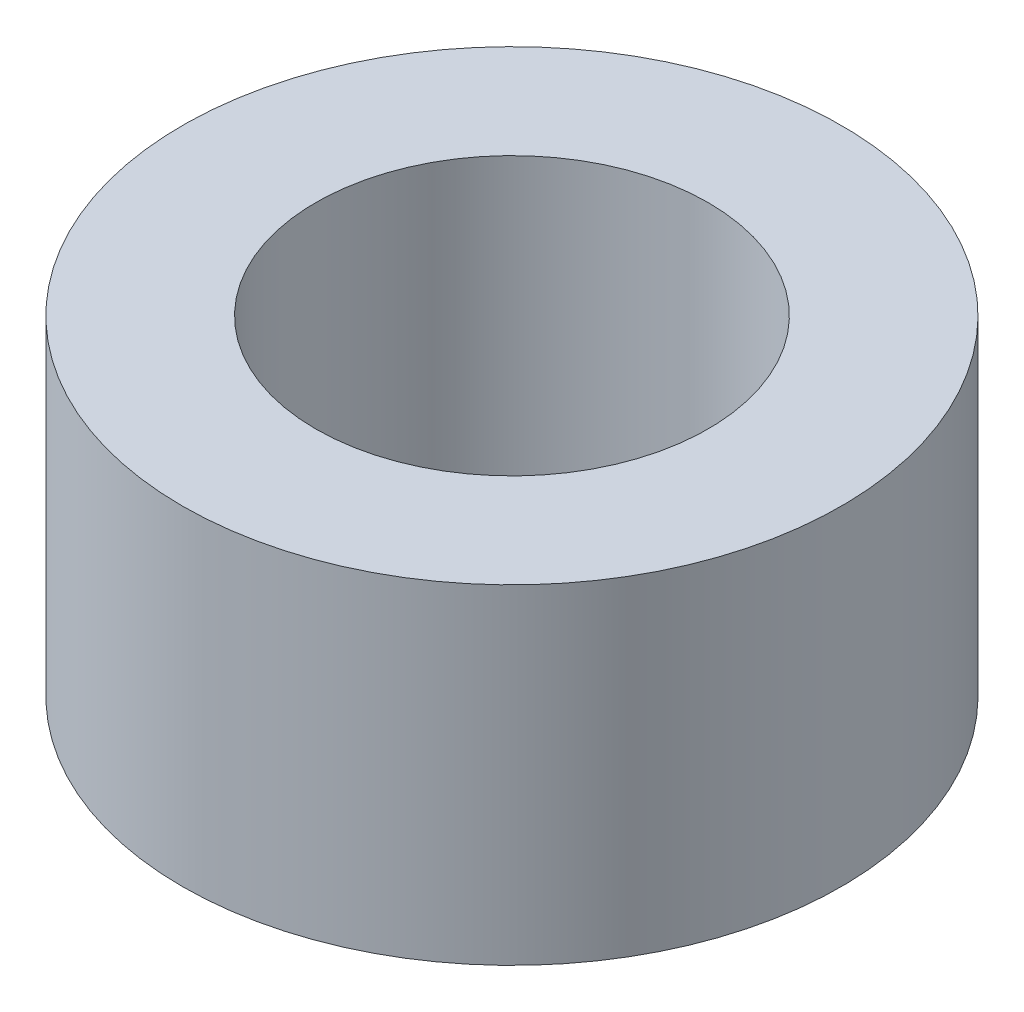
ISO-10303-21;
HEADER;
FILE_DESCRIPTION(('STEP AP214'),'2;1');
FILE_NAME('part.step','',(''),(''),'','','');
FILE_SCHEMA(('AUTOMOTIVE_DESIGN { 1 0 10303 214 1 1 1 1 }'));
ENDSEC;
DATA;
#1=APPLICATION_CONTEXT('core data for automotive mechanical design processes');
#2=APPLICATION_PROTOCOL_DEFINITION('international standard','automotive_design',2000,#1);
#3=PRODUCT_CONTEXT('',#1,'mechanical');
#4=PRODUCT('Part','Part','',(#3));
#5=PRODUCT_RELATED_PRODUCT_CATEGORY('part','',(#4));
#6=PRODUCT_DEFINITION_FORMATION('','',#4);
#7=PRODUCT_DEFINITION_CONTEXT('part definition',#1,'design');
#8=PRODUCT_DEFINITION('design','',#6,#7);
#9=PRODUCT_DEFINITION_SHAPE('','',#8);
#10=(LENGTH_UNIT() NAMED_UNIT(*) SI_UNIT(.MILLI.,.METRE.));
#11=(NAMED_UNIT(*) PLANE_ANGLE_UNIT() SI_UNIT($,.RADIAN.));
#12=(NAMED_UNIT(*) SI_UNIT($,.STERADIAN.) SOLID_ANGLE_UNIT());
#13=UNCERTAINTY_MEASURE_WITH_UNIT(LENGTH_MEASURE(1.E-05),#10,'distance_accuracy_value','');
#14=(GEOMETRIC_REPRESENTATION_CONTEXT(3) GLOBAL_UNCERTAINTY_ASSIGNED_CONTEXT((#13)) GLOBAL_UNIT_ASSIGNED_CONTEXT((#10,
#11,#12)) REPRESENTATION_CONTEXT('',''));
#15=CARTESIAN_POINT('',(0.,0.,0.));
#16=DIRECTION('',(0.,0.,1.));
#17=DIRECTION('',(1.,0.,0.));
#18=AXIS2_PLACEMENT_3D('',#15,#16,#17);
#19=CARTESIAN_POINT('',(0.,21.,0.));
#20=DIRECTION('',(0.,1.,0.));
#21=DIRECTION('',(0.,0.,1.));
#22=AXIS2_PLACEMENT_3D('',#19,#20,#21);
#23=PLANE('',#22);
#24=CARTESIAN_POINT('',(0.,21.,0.));
#25=DIRECTION('',(0.,1.,0.));
#26=DIRECTION('',(0.,0.,1.));
#27=AXIS2_PLACEMENT_3D('',#24,#25,#26);
#28=CIRCLE('',#27,21.);
#29=CARTESIAN_POINT('',(0.,21.,21.));
#30=VERTEX_POINT('',#29);
#31=EDGE_CURVE('E10',#30,#30,#28,.T.);
#32=ORIENTED_EDGE('',*,*,#31,.T.);
#33=EDGE_LOOP('',(#32));
#34=FACE_BOUND('',#33,.T.);
#35=CARTESIAN_POINT('',(0.,21.,0.));
#36=DIRECTION('',(0.,1.,0.));
#37=DIRECTION('',(0.,0.,1.));
#38=AXIS2_PLACEMENT_3D('',#35,#36,#37);
#39=CIRCLE('',#38,12.5);
#40=CARTESIAN_POINT('',(0.,21.,12.5));
#41=VERTEX_POINT('',#40);
#42=EDGE_CURVE('E43',#41,#41,#39,.T.);
#43=ORIENTED_EDGE('',*,*,#42,.F.);
#44=EDGE_LOOP('',(#43));
#45=FACE_BOUND('',#44,.T.);
#46=ADVANCED_FACE('F32',(#34,#45),#23,.T.);
#47=CARTESIAN_POINT('',(0.,0.,0.));
#48=DIRECTION('',(0.,1.,0.));
#49=DIRECTION('',(0.,0.,1.));
#50=AXIS2_PLACEMENT_3D('',#47,#48,#49);
#51=PLANE('',#50);
#52=CARTESIAN_POINT('',(0.,0.,0.));
#53=DIRECTION('',(0.,1.,0.));
#54=DIRECTION('',(0.,0.,1.));
#55=AXIS2_PLACEMENT_3D('',#52,#53,#54);
#56=CIRCLE('',#55,21.);
#57=CARTESIAN_POINT('',(0.,0.,21.));
#58=VERTEX_POINT('',#57);
#59=EDGE_CURVE('E36',#58,#58,#56,.T.);
#60=ORIENTED_EDGE('',*,*,#59,.F.);
#61=EDGE_LOOP('',(#60));
#62=FACE_BOUND('',#61,.T.);
#63=CARTESIAN_POINT('',(0.,0.,0.));
#64=DIRECTION('',(0.,1.,0.));
#65=DIRECTION('',(0.,0.,1.));
#66=AXIS2_PLACEMENT_3D('',#63,#64,#65);
#67=CIRCLE('',#66,12.5);
#68=CARTESIAN_POINT('',(0.,0.,12.5));
#69=VERTEX_POINT('',#68);
#70=EDGE_CURVE('E45',#69,#69,#67,.T.);
#71=ORIENTED_EDGE('',*,*,#70,.T.);
#72=EDGE_LOOP('',(#71));
#73=FACE_BOUND('',#72,.T.);
#74=ADVANCED_FACE('F55',(#62,#73),#51,.F.);
#75=CARTESIAN_POINT('',(0.,21.,0.));
#76=DIRECTION('',(0.,-1.,0.));
#77=DIRECTION('',(0.,0.,-1.));
#78=AXIS2_PLACEMENT_3D('',#75,#76,#77);
#79=CYLINDRICAL_SURFACE('',#78,21.);
#80=ORIENTED_EDGE('',*,*,#31,.F.);
#81=EDGE_LOOP('',(#80));
#82=FACE_BOUND('',#81,.T.);
#83=ORIENTED_EDGE('',*,*,#59,.T.);
#84=EDGE_LOOP('',(#83));
#85=FACE_BOUND('',#84,.T.);
#86=ADVANCED_FACE('F34',(#82,#85),#79,.T.);
#87=CARTESIAN_POINT('',(0.,21.,0.));
#88=DIRECTION('',(0.,-1.,0.));
#89=DIRECTION('',(0.,0.,-1.));
#90=AXIS2_PLACEMENT_3D('',#87,#88,#89);
#91=CYLINDRICAL_SURFACE('',#90,12.5);
#92=ORIENTED_EDGE('',*,*,#42,.T.);
#93=EDGE_LOOP('',(#92));
#94=FACE_BOUND('',#93,.T.);
#95=ORIENTED_EDGE('',*,*,#70,.F.);
#96=EDGE_LOOP('',(#95));
#97=FACE_BOUND('',#96,.T.);
#98=ADVANCED_FACE('F51',(#94,#97),#91,.F.);
#99=CLOSED_SHELL('',(#46,#74,#86,#98));
#100=MANIFOLD_SOLID_BREP('B2',#99);
#101=ADVANCED_BREP_SHAPE_REPRESENTATION('',(#18,#100),#14);
#102=SHAPE_DEFINITION_REPRESENTATION(#9,#101);
ENDSEC;
END-ISO-10303-21;
